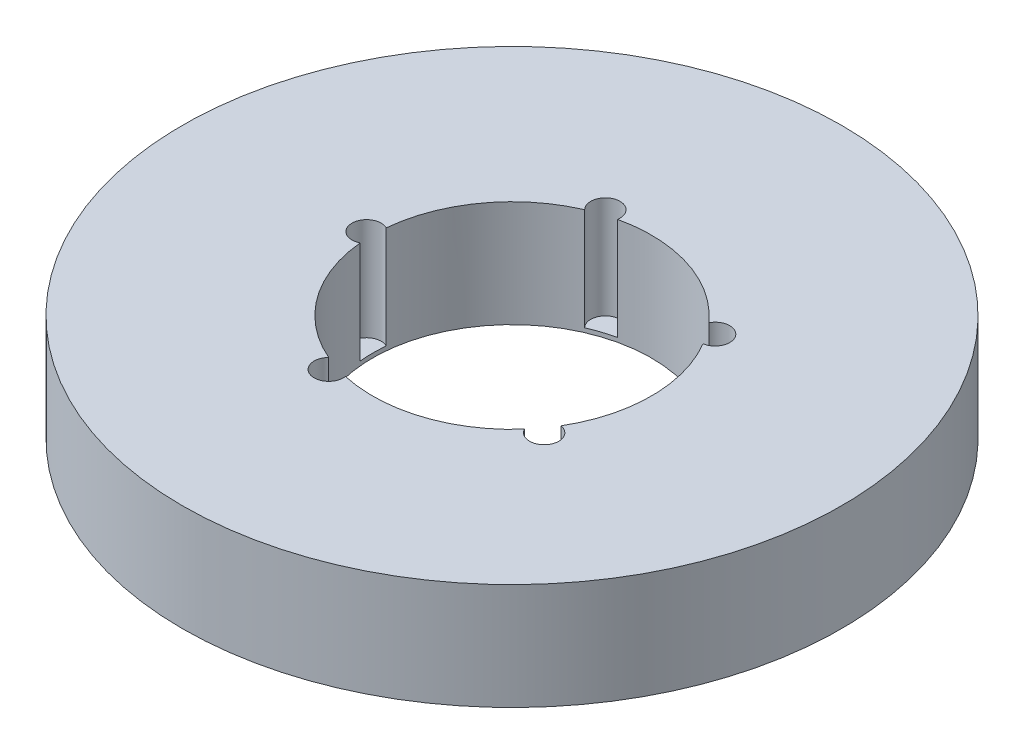
ISO-10303-21;
HEADER;
FILE_DESCRIPTION(('STEP AP214'),'2;1');
FILE_NAME('part.step','',(''),(''),'','','');
FILE_SCHEMA(('AUTOMOTIVE_DESIGN { 1 0 10303 214 1 1 1 1 }'));
ENDSEC;
DATA;
#1=APPLICATION_CONTEXT('core data for automotive mechanical design processes');
#2=APPLICATION_PROTOCOL_DEFINITION('international standard','automotive_design',2000,#1);
#3=PRODUCT_CONTEXT('',#1,'mechanical');
#4=PRODUCT('Part','Part','',(#3));
#5=PRODUCT_RELATED_PRODUCT_CATEGORY('part','',(#4));
#6=PRODUCT_DEFINITION_FORMATION('','',#4);
#7=PRODUCT_DEFINITION_CONTEXT('part definition',#1,'design');
#8=PRODUCT_DEFINITION('design','',#6,#7);
#9=PRODUCT_DEFINITION_SHAPE('','',#8);
#10=(LENGTH_UNIT() NAMED_UNIT(*) SI_UNIT(.MILLI.,.METRE.));
#11=(NAMED_UNIT(*) PLANE_ANGLE_UNIT() SI_UNIT($,.RADIAN.));
#12=(NAMED_UNIT(*) SI_UNIT($,.STERADIAN.) SOLID_ANGLE_UNIT());
#13=UNCERTAINTY_MEASURE_WITH_UNIT(LENGTH_MEASURE(1.E-05),#10,'distance_accuracy_value','');
#14=(GEOMETRIC_REPRESENTATION_CONTEXT(3) GLOBAL_UNCERTAINTY_ASSIGNED_CONTEXT((#13)) GLOBAL_UNIT_ASSIGNED_CONTEXT((#10,
#11,#12)) REPRESENTATION_CONTEXT('',''));
#15=CARTESIAN_POINT('',(0.,0.,0.));
#16=DIRECTION('',(0.,0.,1.));
#17=DIRECTION('',(1.,0.,0.));
#18=AXIS2_PLACEMENT_3D('',#15,#16,#17);
#19=CARTESIAN_POINT('',(0.,21.,0.));
#20=DIRECTION('',(0.,-1.,0.));
#21=DIRECTION('',(0.,0.,-1.));
#22=AXIS2_PLACEMENT_3D('',#19,#20,#21);
#23=CYLINDRICAL_SURFACE('',#22,65.);
#24=CARTESIAN_POINT('',(0.,21.,0.));
#25=DIRECTION('',(0.,1.,0.));
#26=DIRECTION('',(0.,0.,1.));
#27=AXIS2_PLACEMENT_3D('',#24,#25,#26);
#28=CIRCLE('',#27,65.);
#29=CARTESIAN_POINT('',(0.,21.,-65.));
#30=VERTEX_POINT('',#29);
#31=EDGE_CURVE('E160',#30,#30,#28,.T.);
#32=CARTESIAN_POINT('',(0.,0.,0.));
#33=DIRECTION('',(0.,1.,0.));
#34=DIRECTION('',(0.,0.,1.));
#35=AXIS2_PLACEMENT_3D('',#32,#33,#34);
#36=CIRCLE('',#35,65.);
#37=CARTESIAN_POINT('',(0.,0.,-65.));
#38=VERTEX_POINT('',#37);
#39=EDGE_CURVE('E153',#38,#38,#36,.T.);
#40=CARTESIAN_POINT('',(0.,21.,-65.));
#41=CARTESIAN_POINT('',(0.,20.78125,-65.));
#42=CARTESIAN_POINT('',(0.,20.5625,-65.));
#43=CARTESIAN_POINT('',(0.,20.125,-65.));
#44=CARTESIAN_POINT('',(0.,19.90625,-65.));
#45=CARTESIAN_POINT('',(0.,19.46875,-65.));
#46=CARTESIAN_POINT('',(0.,19.25,-65.));
#47=CARTESIAN_POINT('',(0.,18.8125,-65.));
#48=CARTESIAN_POINT('',(0.,18.59375,-65.));
#49=CARTESIAN_POINT('',(0.,18.15625,-65.));
#50=CARTESIAN_POINT('',(0.,17.9375,-65.));
#51=CARTESIAN_POINT('',(0.,17.5,-65.));
#52=CARTESIAN_POINT('',(0.,17.28125,-65.));
#53=CARTESIAN_POINT('',(0.,16.84375,-65.));
#54=CARTESIAN_POINT('',(0.,16.625,-65.));
#55=CARTESIAN_POINT('',(0.,16.1875,-65.));
#56=CARTESIAN_POINT('',(0.,15.96875,-65.));
#57=CARTESIAN_POINT('',(0.,15.53125,-65.));
#58=CARTESIAN_POINT('',(0.,15.3125,-65.));
#59=CARTESIAN_POINT('',(0.,14.875,-65.));
#60=CARTESIAN_POINT('',(0.,14.65625,-65.));
#61=CARTESIAN_POINT('',(0.,14.21875,-65.));
#62=CARTESIAN_POINT('',(0.,14.,-65.));
#63=CARTESIAN_POINT('',(0.,13.5625,-65.));
#64=CARTESIAN_POINT('',(0.,13.34375,-65.));
#65=CARTESIAN_POINT('',(0.,12.90625,-65.));
#66=CARTESIAN_POINT('',(0.,12.6875,-65.));
#67=CARTESIAN_POINT('',(0.,12.25,-65.));
#68=CARTESIAN_POINT('',(0.,12.03125,-65.));
#69=CARTESIAN_POINT('',(0.,11.59375,-65.));
#70=CARTESIAN_POINT('',(0.,11.375,-65.));
#71=CARTESIAN_POINT('',(0.,10.9375,-65.));
#72=CARTESIAN_POINT('',(0.,10.71875,-65.));
#73=CARTESIAN_POINT('',(0.,10.28125,-65.));
#74=CARTESIAN_POINT('',(0.,10.0625,-65.));
#75=CARTESIAN_POINT('',(0.,9.625,-65.));
#76=CARTESIAN_POINT('',(0.,9.40625,-65.));
#77=CARTESIAN_POINT('',(0.,8.96875,-65.));
#78=CARTESIAN_POINT('',(0.,8.75,-65.));
#79=CARTESIAN_POINT('',(0.,8.3125,-65.));
#80=CARTESIAN_POINT('',(0.,8.09375,-65.));
#81=CARTESIAN_POINT('',(0.,7.65625,-65.));
#82=CARTESIAN_POINT('',(0.,7.4375,-65.));
#83=CARTESIAN_POINT('',(0.,7.,-65.));
#84=CARTESIAN_POINT('',(0.,6.78125,-65.));
#85=CARTESIAN_POINT('',(0.,6.34375,-65.));
#86=CARTESIAN_POINT('',(0.,6.125,-65.));
#87=CARTESIAN_POINT('',(0.,5.6875,-65.));
#88=CARTESIAN_POINT('',(0.,5.46875,-65.));
#89=CARTESIAN_POINT('',(0.,5.03125,-65.));
#90=CARTESIAN_POINT('',(0.,4.8125,-65.));
#91=CARTESIAN_POINT('',(0.,4.375,-65.));
#92=CARTESIAN_POINT('',(0.,4.15625,-65.));
#93=CARTESIAN_POINT('',(0.,3.71875,-65.));
#94=CARTESIAN_POINT('',(0.,3.5,-65.));
#95=CARTESIAN_POINT('',(0.,3.0625,-65.));
#96=CARTESIAN_POINT('',(0.,2.84375,-65.));
#97=CARTESIAN_POINT('',(0.,2.40625,-65.));
#98=CARTESIAN_POINT('',(0.,2.1875,-65.));
#99=CARTESIAN_POINT('',(0.,1.75,-65.));
#100=CARTESIAN_POINT('',(0.,1.53125,-65.));
#101=CARTESIAN_POINT('',(0.,1.09375,-65.));
#102=CARTESIAN_POINT('',(0.,0.875000000000001,-65.));
#103=CARTESIAN_POINT('',(0.,0.4375,-65.));
#104=CARTESIAN_POINT('',(0.,0.21875,-65.));
#105=CARTESIAN_POINT('',(0.,0.,-65.));
#106=B_SPLINE_CURVE_WITH_KNOTS('',3,(#40,#41,#42,#43,#44,#45,#46,#47,#48,#49,#50,#51,#52,#53,
#54,#55,#56,#57,#58,#59,#60,#61,#62,#63,#64,#65,#66,#67,#68,#69,#70,#71,#72,#73,#74,#75,#76,#77,
#78,#79,#80,#81,#82,#83,#84,#85,#86,#87,#88,#89,#90,#91,#92,#93,#94,#95,#96,#97,#98,#99,#100,
#101,#102,#103,#104,#105),.UNSPECIFIED.,.F.,.F.,(4,2,2,2,2,2,2,2,2,2,2,2,2,2,2,2,2,2,2,2,2,2,2,
2,2,2,2,2,2,2,2,2,4),(0.,0.656249999999997,1.3125,1.96875,2.625,3.28125,3.9375,4.59375,5.25,
5.90625,6.5625,7.21875,7.875,8.53125,9.1875,9.84375,10.5,11.15625,11.8125,12.46875,13.125,
13.78125,14.4375,15.09375,15.75,16.40625,17.0625,17.71875,18.375,19.03125,19.6875,20.34375,21.),.UNSPECIFIED.);
#107=EDGE_CURVE('BSEAM39',#30,#38,#106,.T.);
#108=ORIENTED_EDGE('',*,*,#31,.F.);
#109=ORIENTED_EDGE('',*,*,#39,.T.);
#110=ORIENTED_EDGE('',*,*,#107,.T.);
#111=ORIENTED_EDGE('',*,*,#107,.F.);
#112=EDGE_LOOP('',(#108,#110,#109,#111));
#113=FACE_BOUND('',#112,.T.);
#114=ADVANCED_FACE('F39',(#113),#23,.T.);
#115=CARTESIAN_POINT('',(0.,21.,0.));
#116=DIRECTION('',(0.,1.,0.));
#117=DIRECTION('',(0.,0.,1.));
#118=AXIS2_PLACEMENT_3D('',#115,#116,#117);
#119=PLANE('',#118);
#120=CARTESIAN_POINT('',(-8.86405857727803,21.,27.280767155846));
#121=DIRECTION('',(0.,1.,0.));
#122=DIRECTION('',(0.951056516295155,0.,0.309016994374945));
#123=AXIS2_PLACEMENT_3D('',#120,#121,#122);
#124=CIRCLE('',#123,2.88531558220189);
#125=CARTESIAN_POINT('',(-10.9078996390309,21.,25.2441622056433));
#126=VERTEX_POINT('',#125);
#127=CARTESIAN_POINT('',(-6.01347007004366,21.,26.834458774432));
#128=VERTEX_POINT('',#127);
#129=EDGE_CURVE('E186',#126,#128,#124,.T.);
#130=ORIENTED_EDGE('',*,*,#129,.F.);
#131=CARTESIAN_POINT('',(0.,21.,0.));
#132=DIRECTION('',(0.,1.,0.));
#133=DIRECTION('',(0.,0.,1.));
#134=AXIS2_PLACEMENT_3D('',#131,#132,#133);
#135=CIRCLE('',#134,27.5);
#136=CARTESIAN_POINT('',(-27.3793513254858,21.,2.57315390049243));
#137=VERTEX_POINT('',#136);
#138=EDGE_CURVE('E148',#137,#126,#135,.T.);
#139=ORIENTED_EDGE('',*,*,#138,.F.);
#140=CARTESIAN_POINT('',(-28.684696112612,21.,0.));
#141=DIRECTION('',(0.,1.,0.));
#142=DIRECTION('',(0.,0.,1.));
#143=AXIS2_PLACEMENT_3D('',#140,#141,#142);
#144=CIRCLE('',#143,2.88531558220189);
#145=CARTESIAN_POINT('',(-27.3793513254858,21.,-2.57315390049243));
#146=VERTEX_POINT('',#145);
#147=EDGE_CURVE('E142',#146,#137,#144,.T.);
#148=ORIENTED_EDGE('',*,*,#147,.F.);
#149=CARTESIAN_POINT('',(-10.9078996390313,21.,-25.2441622056431));
#150=VERTEX_POINT('',#149);
#151=EDGE_CURVE('E132',#150,#146,#135,.T.);
#152=ORIENTED_EDGE('',*,*,#151,.F.);
#153=CARTESIAN_POINT('',(-8.86405857727841,21.,-27.2807671558458));
#154=DIRECTION('',(0.,1.,0.));
#155=DIRECTION('',(-0.95105651629515,0.,0.309016994374958));
#156=AXIS2_PLACEMENT_3D('',#153,#154,#155);
#157=CIRCLE('',#156,2.88531558220189);
#158=CARTESIAN_POINT('',(-6.01347007004404,21.,-26.8344587744319));
#159=VERTEX_POINT('',#158);
#160=EDGE_CURVE('E111',#159,#150,#157,.T.);
#161=ORIENTED_EDGE('',*,*,#160,.F.);
#162=CARTESIAN_POINT('',(20.6378986026918,21.,-18.1749041610957));
#163=VERTEX_POINT('',#162);
#164=EDGE_CURVE('E141',#163,#159,#135,.T.);
#165=ORIENTED_EDGE('',*,*,#164,.F.);
#166=CARTESIAN_POINT('',(23.206406633584,21.,-16.8604413414848));
#167=DIRECTION('',(0.,1.,0.));
#168=DIRECTION('',(-0.58778525229248,0.,-0.809016994374942));
#169=AXIS2_PLACEMENT_3D('',#166,#167,#168);
#170=CIRCLE('',#169,2.88531558220189);
#171=CARTESIAN_POINT('',(23.6628224318684,21.,-14.0114536918146));
#172=VERTEX_POINT('',#171);
#173=EDGE_CURVE('E173',#172,#163,#170,.T.);
#174=ORIENTED_EDGE('',*,*,#173,.F.);
#175=CARTESIAN_POINT('',(23.6628224318686,21.,14.0114536918142));
#176=VERTEX_POINT('',#175);
#177=EDGE_CURVE('E150',#176,#172,#135,.T.);
#178=ORIENTED_EDGE('',*,*,#177,.F.);
#179=CARTESIAN_POINT('',(23.2064066335842,21.,16.8604413414844));
#180=DIRECTION('',(0.,1.,0.));
#181=DIRECTION('',(0.587785252292469,0.,-0.809016994374951));
#182=AXIS2_PLACEMENT_3D('',#179,#180,#181);
#183=CIRCLE('',#182,2.88531558220189);
#184=CARTESIAN_POINT('',(20.637898602692,21.,18.1749041610954));
#185=VERTEX_POINT('',#184);
#186=EDGE_CURVE('E172',#185,#176,#183,.T.);
#187=ORIENTED_EDGE('',*,*,#186,.F.);
#188=EDGE_CURVE('E152',#128,#185,#135,.T.);
#189=ORIENTED_EDGE('',*,*,#188,.F.);
#190=EDGE_LOOP('',(#130,#139,#148,#152,#161,#165,#174,#178,#187,#189));
#191=FACE_BOUND('',#190,.T.);
#192=ORIENTED_EDGE('',*,*,#31,.T.);
#193=EDGE_LOOP('',(#192));
#194=FACE_BOUND('',#193,.T.);
#195=ADVANCED_FACE('F138',(#191,#194),#119,.T.);
#196=CARTESIAN_POINT('',(0.,0.,0.));
#197=DIRECTION('',(0.,1.,0.));
#198=DIRECTION('',(0.,0.,1.));
#199=AXIS2_PLACEMENT_3D('',#196,#197,#198);
#200=PLANE('',#199);
#201=CARTESIAN_POINT('',(0.,0.,0.));
#202=DIRECTION('',(0.,1.,0.));
#203=DIRECTION('',(0.,0.,1.));
#204=AXIS2_PLACEMENT_3D('',#201,#202,#203);
#205=CIRCLE('',#204,27.5);
#206=CARTESIAN_POINT('',(0.,0.,27.5));
#207=VERTEX_POINT('',#206);
#208=EDGE_CURVE('E145',#207,#207,#205,.T.);
#209=ORIENTED_EDGE('',*,*,#208,.T.);
#210=EDGE_LOOP('',(#209));
#211=FACE_BOUND('',#210,.T.);
#212=ORIENTED_EDGE('',*,*,#39,.F.);
#213=EDGE_LOOP('',(#212));
#214=FACE_BOUND('',#213,.T.);
#215=ADVANCED_FACE('F216',(#211,#214),#200,.F.);
#216=CARTESIAN_POINT('',(0.,21.,0.));
#217=DIRECTION('',(0.,-1.,0.));
#218=DIRECTION('',(0.,0.,-1.));
#219=AXIS2_PLACEMENT_3D('',#216,#217,#218);
#220=CYLINDRICAL_SURFACE('',#219,27.5);
#221=DIRECTION('',(0.,1.,0.));
#222=VECTOR('',#221,1.);
#223=CARTESIAN_POINT('',(-10.9078996390309,10.9131048061023,25.2441622056433));
#224=LINE('',#223,#222);
#225=CARTESIAN_POINT('',(-10.9078996390309,0.826209612204525,25.2441622056433));
#226=VERTEX_POINT('',#225);
#227=EDGE_CURVE('E11',#226,#126,#224,.T.);
#228=ORIENTED_EDGE('',*,*,#227,.F.);
#229=CARTESIAN_POINT('',(0.,0.826209612204525,0.));
#230=DIRECTION('',(0.,1.,0.));
#231=DIRECTION('',(0.,0.,1.));
#232=AXIS2_PLACEMENT_3D('',#229,#230,#231);
#233=CIRCLE('',#232,27.5);
#234=CARTESIAN_POINT('',(-6.01347007004366,0.826209612204525,26.834458774432));
#235=VERTEX_POINT('',#234);
#236=EDGE_CURVE('E192',#226,#235,#233,.T.);
#237=ORIENTED_EDGE('',*,*,#236,.T.);
#238=DIRECTION('',(0.,1.,0.));
#239=VECTOR('',#238,1.);
#240=CARTESIAN_POINT('',(-6.01347007004366,10.9131048061023,26.834458774432));
#241=LINE('',#240,#239);
#242=EDGE_CURVE('E46',#128,#235,#241,.F.);
#243=ORIENTED_EDGE('',*,*,#242,.F.);
#244=ORIENTED_EDGE('',*,*,#188,.T.);
#245=DIRECTION('',(0.,1.,0.));
#246=VECTOR('',#245,1.);
#247=CARTESIAN_POINT('',(20.637898602692,10.9131048061023,18.1749041610954));
#248=LINE('',#247,#246);
#249=CARTESIAN_POINT('',(20.637898602692,0.826209612204525,18.1749041610954));
#250=VERTEX_POINT('',#249);
#251=EDGE_CURVE('E195',#250,#185,#248,.T.);
#252=ORIENTED_EDGE('',*,*,#251,.F.);
#253=CARTESIAN_POINT('',(0.,0.826209612204525,0.));
#254=DIRECTION('',(0.,1.,0.));
#255=DIRECTION('',(0.,0.,1.));
#256=AXIS2_PLACEMENT_3D('',#253,#254,#255);
#257=CIRCLE('',#256,27.5);
#258=CARTESIAN_POINT('',(23.6628224318686,0.826209612204525,14.0114536918142));
#259=VERTEX_POINT('',#258);
#260=EDGE_CURVE('E197',#250,#259,#257,.T.);
#261=ORIENTED_EDGE('',*,*,#260,.T.);
#262=DIRECTION('',(0.,1.,0.));
#263=VECTOR('',#262,1.);
#264=CARTESIAN_POINT('',(23.6628224318686,10.9131048061023,14.0114536918142));
#265=LINE('',#264,#263);
#266=EDGE_CURVE('E168',#176,#259,#265,.F.);
#267=ORIENTED_EDGE('',*,*,#266,.F.);
#268=ORIENTED_EDGE('',*,*,#177,.T.);
#269=DIRECTION('',(0.,1.,0.));
#270=VECTOR('',#269,1.);
#271=CARTESIAN_POINT('',(23.6628224318684,10.9131048061023,-14.0114536918146));
#272=LINE('',#271,#270);
#273=CARTESIAN_POINT('',(23.6628224318684,0.826209612204525,-14.0114536918146));
#274=VERTEX_POINT('',#273);
#275=EDGE_CURVE('E169',#274,#172,#272,.T.);
#276=ORIENTED_EDGE('',*,*,#275,.F.);
#277=CARTESIAN_POINT('',(0.,0.826209612204525,0.));
#278=DIRECTION('',(0.,1.,0.));
#279=DIRECTION('',(0.,0.,1.));
#280=AXIS2_PLACEMENT_3D('',#277,#278,#279);
#281=CIRCLE('',#280,27.5);
#282=CARTESIAN_POINT('',(20.6378986026918,0.826209612204525,-18.1749041610957));
#283=VERTEX_POINT('',#282);
#284=EDGE_CURVE('E332',#274,#283,#281,.T.);
#285=ORIENTED_EDGE('',*,*,#284,.T.);
#286=DIRECTION('',(0.,1.,0.));
#287=VECTOR('',#286,1.);
#288=CARTESIAN_POINT('',(20.6378986026918,10.9131048061023,-18.1749041610957));
#289=LINE('',#288,#287);
#290=EDGE_CURVE('E335',#163,#283,#289,.F.);
#291=ORIENTED_EDGE('',*,*,#290,.F.);
#292=ORIENTED_EDGE('',*,*,#164,.T.);
#293=DIRECTION('',(0.,1.,0.));
#294=VECTOR('',#293,1.);
#295=CARTESIAN_POINT('',(-6.01347007004404,10.9131048061023,-26.8344587744319));
#296=LINE('',#295,#294);
#297=CARTESIAN_POINT('',(-6.01347007004404,0.826209612204525,-26.8344587744319));
#298=VERTEX_POINT('',#297);
#299=EDGE_CURVE('E121',#298,#159,#296,.T.);
#300=ORIENTED_EDGE('',*,*,#299,.F.);
#301=CARTESIAN_POINT('',(0.,0.826209612204525,0.));
#302=DIRECTION('',(0.,1.,0.));
#303=DIRECTION('',(0.,0.,1.));
#304=AXIS2_PLACEMENT_3D('',#301,#302,#303);
#305=CIRCLE('',#304,27.5);
#306=CARTESIAN_POINT('',(-10.9078996390313,0.826209612204525,-25.2441622056431));
#307=VERTEX_POINT('',#306);
#308=EDGE_CURVE('E134',#298,#307,#305,.T.);
#309=ORIENTED_EDGE('',*,*,#308,.T.);
#310=DIRECTION('',(0.,1.,0.));
#311=VECTOR('',#310,1.);
#312=CARTESIAN_POINT('',(-10.9078996390312,10.9131048061023,-25.2441622056431));
#313=LINE('',#312,#311);
#314=EDGE_CURVE('E117',#150,#307,#313,.F.);
#315=ORIENTED_EDGE('',*,*,#314,.F.);
#316=ORIENTED_EDGE('',*,*,#151,.T.);
#317=DIRECTION('',(0.,1.,0.));
#318=VECTOR('',#317,1.);
#319=CARTESIAN_POINT('',(-27.3793513254858,10.9131048061023,-2.57315390049243));
#320=LINE('',#319,#318);
#321=CARTESIAN_POINT('',(-27.3793513254858,0.826209612204525,-2.57315390049243));
#322=VERTEX_POINT('',#321);
#323=EDGE_CURVE('E338',#322,#146,#320,.T.);
#324=ORIENTED_EDGE('',*,*,#323,.F.);
#325=CARTESIAN_POINT('',(0.,0.826209612204525,0.));
#326=DIRECTION('',(0.,1.,0.));
#327=DIRECTION('',(0.,0.,1.));
#328=AXIS2_PLACEMENT_3D('',#325,#326,#327);
#329=CIRCLE('',#328,27.5);
#330=CARTESIAN_POINT('',(-27.3793513254858,0.826209612204525,2.57315390049243));
#331=VERTEX_POINT('',#330);
#332=EDGE_CURVE('E342',#322,#331,#329,.T.);
#333=ORIENTED_EDGE('',*,*,#332,.T.);
#334=DIRECTION('',(0.,1.,0.));
#335=VECTOR('',#334,1.);
#336=CARTESIAN_POINT('',(-27.3793513254858,10.9131048061023,2.57315390049243));
#337=LINE('',#336,#335);
#338=EDGE_CURVE('E341',#137,#331,#337,.F.);
#339=ORIENTED_EDGE('',*,*,#338,.F.);
#340=ORIENTED_EDGE('',*,*,#138,.T.);
#341=EDGE_LOOP('',(#228,#237,#243,#244,#252,#261,#267,#268,#276,#285,#291,#292,#300,#309,#315,
#316,#324,#333,#339,#340));
#342=FACE_BOUND('',#341,.T.);
#343=ORIENTED_EDGE('',*,*,#208,.F.);
#344=EDGE_LOOP('',(#343));
#345=FACE_BOUND('',#344,.T.);
#346=ADVANCED_FACE('F128',(#342,#345),#220,.F.);
#347=CARTESIAN_POINT('',(-28.684696112612,0.826209612204525,0.));
#348=DIRECTION('',(0.,1.,0.));
#349=DIRECTION('',(0.,0.,1.));
#350=AXIS2_PLACEMENT_3D('',#347,#348,#349);
#351=CYLINDRICAL_SURFACE('',#350,2.88531558220189);
#352=ORIENTED_EDGE('',*,*,#323,.T.);
#353=ORIENTED_EDGE('',*,*,#147,.T.);
#354=ORIENTED_EDGE('',*,*,#338,.T.);
#355=CARTESIAN_POINT('',(-28.684696112612,0.826209612204525,0.));
#356=DIRECTION('',(0.,1.,0.));
#357=DIRECTION('',(0.,0.,1.));
#358=AXIS2_PLACEMENT_3D('',#355,#356,#357);
#359=CIRCLE('',#358,2.88531558220189);
#360=EDGE_CURVE('E149',#322,#331,#359,.T.);
#361=ORIENTED_EDGE('',*,*,#360,.F.);
#362=EDGE_LOOP('',(#352,#353,#354,#361));
#363=FACE_BOUND('',#362,.T.);
#364=ADVANCED_FACE('F227',(#363),#351,.F.);
#365=CARTESIAN_POINT('',(-28.684696112612,0.826209612204525,0.));
#366=DIRECTION('',(0.,1.,0.));
#367=DIRECTION('',(0.,0.,1.));
#368=AXIS2_PLACEMENT_3D('',#365,#366,#367);
#369=PLANE('',#368);
#370=ORIENTED_EDGE('',*,*,#360,.T.);
#371=ORIENTED_EDGE('',*,*,#332,.F.);
#372=EDGE_LOOP('',(#370,#371));
#373=FACE_BOUND('',#372,.T.);
#374=ADVANCED_FACE('F235',(#373),#369,.T.);
#375=CARTESIAN_POINT('',(-8.86405857727841,0.826209612204525,-27.2807671558458));
#376=DIRECTION('',(0.,1.,0.));
#377=DIRECTION('',(0.,0.,1.));
#378=AXIS2_PLACEMENT_3D('',#375,#376,#377);
#379=CYLINDRICAL_SURFACE('',#378,2.88531558220189);
#380=ORIENTED_EDGE('',*,*,#299,.T.);
#381=ORIENTED_EDGE('',*,*,#160,.T.);
#382=ORIENTED_EDGE('',*,*,#314,.T.);
#383=CARTESIAN_POINT('',(-8.86405857727841,0.826209612204525,-27.2807671558458));
#384=DIRECTION('',(0.,1.,0.));
#385=DIRECTION('',(-0.95105651629515,0.,0.309016994374958));
#386=AXIS2_PLACEMENT_3D('',#383,#384,#385);
#387=CIRCLE('',#386,2.88531558220189);
#388=EDGE_CURVE('E127',#298,#307,#387,.T.);
#389=ORIENTED_EDGE('',*,*,#388,.F.);
#390=EDGE_LOOP('',(#380,#381,#382,#389));
#391=FACE_BOUND('',#390,.T.);
#392=ADVANCED_FACE('F116',(#391),#379,.F.);
#393=CARTESIAN_POINT('',(-8.86405857727841,0.826209612204525,-27.2807671558458));
#394=DIRECTION('',(0.,1.,0.));
#395=DIRECTION('',(-0.95105651629515,0.,0.309016994374958));
#396=AXIS2_PLACEMENT_3D('',#393,#394,#395);
#397=PLANE('',#396);
#398=ORIENTED_EDGE('',*,*,#388,.T.);
#399=ORIENTED_EDGE('',*,*,#308,.F.);
#400=EDGE_LOOP('',(#398,#399));
#401=FACE_BOUND('',#400,.T.);
#402=ADVANCED_FACE('F236',(#401),#397,.T.);
#403=CARTESIAN_POINT('',(23.206406633584,0.826209612204525,-16.8604413414848));
#404=DIRECTION('',(0.,1.,0.));
#405=DIRECTION('',(0.,0.,1.));
#406=AXIS2_PLACEMENT_3D('',#403,#404,#405);
#407=CYLINDRICAL_SURFACE('',#406,2.88531558220189);
#408=ORIENTED_EDGE('',*,*,#275,.T.);
#409=ORIENTED_EDGE('',*,*,#173,.T.);
#410=ORIENTED_EDGE('',*,*,#290,.T.);
#411=CARTESIAN_POINT('',(23.206406633584,0.826209612204525,-16.8604413414848));
#412=DIRECTION('',(0.,1.,0.));
#413=DIRECTION('',(-0.58778525229248,0.,-0.809016994374942));
#414=AXIS2_PLACEMENT_3D('',#411,#412,#413);
#415=CIRCLE('',#414,2.88531558220189);
#416=EDGE_CURVE('E177',#274,#283,#415,.T.);
#417=ORIENTED_EDGE('',*,*,#416,.F.);
#418=EDGE_LOOP('',(#408,#409,#410,#417));
#419=FACE_BOUND('',#418,.T.);
#420=ADVANCED_FACE('F241',(#419),#407,.F.);
#421=CARTESIAN_POINT('',(23.206406633584,0.826209612204525,-16.8604413414848));
#422=DIRECTION('',(0.,1.,0.));
#423=DIRECTION('',(-0.58778525229248,0.,-0.809016994374942));
#424=AXIS2_PLACEMENT_3D('',#421,#422,#423);
#425=PLANE('',#424);
#426=ORIENTED_EDGE('',*,*,#416,.T.);
#427=ORIENTED_EDGE('',*,*,#284,.F.);
#428=EDGE_LOOP('',(#426,#427));
#429=FACE_BOUND('',#428,.T.);
#430=ADVANCED_FACE('F244',(#429),#425,.T.);
#431=CARTESIAN_POINT('',(23.2064066335842,0.826209612204525,16.8604413414844));
#432=DIRECTION('',(0.,1.,0.));
#433=DIRECTION('',(0.,0.,1.));
#434=AXIS2_PLACEMENT_3D('',#431,#432,#433);
#435=CYLINDRICAL_SURFACE('',#434,2.88531558220189);
#436=ORIENTED_EDGE('',*,*,#251,.T.);
#437=ORIENTED_EDGE('',*,*,#186,.T.);
#438=ORIENTED_EDGE('',*,*,#266,.T.);
#439=CARTESIAN_POINT('',(23.2064066335842,0.826209612204525,16.8604413414844));
#440=DIRECTION('',(0.,1.,0.));
#441=DIRECTION('',(0.587785252292469,0.,-0.809016994374951));
#442=AXIS2_PLACEMENT_3D('',#439,#440,#441);
#443=CIRCLE('',#442,2.88531558220189);
#444=EDGE_CURVE('E56',#250,#259,#443,.T.);
#445=ORIENTED_EDGE('',*,*,#444,.F.);
#446=EDGE_LOOP('',(#436,#437,#438,#445));
#447=FACE_BOUND('',#446,.T.);
#448=ADVANCED_FACE('F191',(#447),#435,.F.);
#449=CARTESIAN_POINT('',(23.2064066335842,0.826209612204525,16.8604413414844));
#450=DIRECTION('',(0.,1.,0.));
#451=DIRECTION('',(0.587785252292469,0.,-0.809016994374951));
#452=AXIS2_PLACEMENT_3D('',#449,#450,#451);
#453=PLANE('',#452);
#454=ORIENTED_EDGE('',*,*,#444,.T.);
#455=ORIENTED_EDGE('',*,*,#260,.F.);
#456=EDGE_LOOP('',(#454,#455));
#457=FACE_BOUND('',#456,.T.);
#458=ADVANCED_FACE('F208',(#457),#453,.T.);
#459=CARTESIAN_POINT('',(-8.86405857727803,0.826209612204525,27.280767155846));
#460=DIRECTION('',(0.,1.,0.));
#461=DIRECTION('',(0.,0.,1.));
#462=AXIS2_PLACEMENT_3D('',#459,#460,#461);
#463=CYLINDRICAL_SURFACE('',#462,2.88531558220189);
#464=ORIENTED_EDGE('',*,*,#227,.T.);
#465=ORIENTED_EDGE('',*,*,#129,.T.);
#466=ORIENTED_EDGE('',*,*,#242,.T.);
#467=CARTESIAN_POINT('',(-8.86405857727803,0.826209612204525,27.280767155846));
#468=DIRECTION('',(0.,1.,0.));
#469=DIRECTION('',(0.951056516295155,0.,0.309016994374945));
#470=AXIS2_PLACEMENT_3D('',#467,#468,#469);
#471=CIRCLE('',#470,2.88531558220189);
#472=EDGE_CURVE('E55',#226,#235,#471,.T.);
#473=ORIENTED_EDGE('',*,*,#472,.F.);
#474=EDGE_LOOP('',(#464,#465,#466,#473));
#475=FACE_BOUND('',#474,.T.);
#476=ADVANCED_FACE('F203',(#475),#463,.F.);
#477=CARTESIAN_POINT('',(-8.86405857727803,0.826209612204525,27.280767155846));
#478=DIRECTION('',(0.,1.,0.));
#479=DIRECTION('',(0.951056516295155,0.,0.309016994374945));
#480=AXIS2_PLACEMENT_3D('',#477,#478,#479);
#481=PLANE('',#480);
#482=ORIENTED_EDGE('',*,*,#472,.T.);
#483=ORIENTED_EDGE('',*,*,#236,.F.);
#484=EDGE_LOOP('',(#482,#483));
#485=FACE_BOUND('',#484,.T.);
#486=ADVANCED_FACE('F205',(#485),#481,.T.);
#487=CLOSED_SHELL('',(#114,#195,#215,#346,#364,#374,#392,#402,#420,#430,#448,#458,#476,#486));
#488=MANIFOLD_SOLID_BREP('B2',#487);
#489=ADVANCED_BREP_SHAPE_REPRESENTATION('',(#18,#488),#14);
#490=SHAPE_DEFINITION_REPRESENTATION(#9,#489);
ENDSEC;
END-ISO-10303-21;
